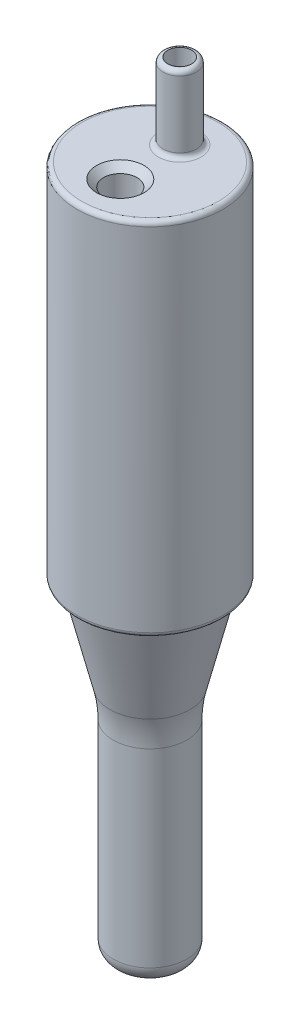
ISO-10303-21;
HEADER;
FILE_DESCRIPTION(('STEP AP214'),'2;1');
FILE_NAME('part.step','',(''),(''),'','','');
FILE_SCHEMA(('AUTOMOTIVE_DESIGN { 1 0 10303 214 1 1 1 1 }'));
ENDSEC;
DATA;
#1=APPLICATION_CONTEXT('core data for automotive mechanical design processes');
#2=APPLICATION_PROTOCOL_DEFINITION('international standard','automotive_design',2000,#1);
#3=PRODUCT_CONTEXT('',#1,'mechanical');
#4=PRODUCT('Part','Part','',(#3));
#5=PRODUCT_RELATED_PRODUCT_CATEGORY('part','',(#4));
#6=PRODUCT_DEFINITION_FORMATION('','',#4);
#7=PRODUCT_DEFINITION_CONTEXT('part definition',#1,'design');
#8=PRODUCT_DEFINITION('design','',#6,#7);
#9=PRODUCT_DEFINITION_SHAPE('','',#8);
#10=(LENGTH_UNIT() NAMED_UNIT(*) SI_UNIT(.MILLI.,.METRE.));
#11=(NAMED_UNIT(*) PLANE_ANGLE_UNIT() SI_UNIT($,.RADIAN.));
#12=(NAMED_UNIT(*) SI_UNIT($,.STERADIAN.) SOLID_ANGLE_UNIT());
#13=UNCERTAINTY_MEASURE_WITH_UNIT(LENGTH_MEASURE(1.E-05),#10,'distance_accuracy_value','');
#14=(GEOMETRIC_REPRESENTATION_CONTEXT(3) GLOBAL_UNCERTAINTY_ASSIGNED_CONTEXT((#13)) GLOBAL_UNIT_ASSIGNED_CONTEXT((#10,
#11,#12)) REPRESENTATION_CONTEXT('',''));
#15=CARTESIAN_POINT('',(0.,0.,0.));
#16=DIRECTION('',(0.,0.,1.));
#17=DIRECTION('',(1.,0.,0.));
#18=AXIS2_PLACEMENT_3D('',#15,#16,#17);
#19=CARTESIAN_POINT('',(0.,0.,-7.81));
#20=DIRECTION('',(0.,-1.,0.));
#21=DIRECTION('',(0.,0.,-1.));
#22=AXIS2_PLACEMENT_3D('',#19,#20,#21);
#23=PLANE('',#22);
#24=CARTESIAN_POINT('',(0.,0.,0.));
#25=DIRECTION('',(0.,-1.,0.));
#26=DIRECTION('',(0.,0.,-1.));
#27=AXIS2_PLACEMENT_3D('',#24,#25,#26);
#28=CIRCLE('',#27,7.31);
#29=CARTESIAN_POINT('',(0.,0.,-7.31));
#30=VERTEX_POINT('',#29);
#31=EDGE_CURVE('E60',#30,#30,#28,.T.);
#32=ORIENTED_EDGE('',*,*,#31,.T.);
#33=EDGE_LOOP('',(#32));
#34=FACE_BOUND('',#33,.T.);
#35=CARTESIAN_POINT('',(0.,0.,0.));
#36=DIRECTION('',(0.,-1.,0.));
#37=DIRECTION('',(0.,0.,-1.));
#38=AXIS2_PLACEMENT_3D('',#35,#36,#37);
#39=CIRCLE('',#38,6.73);
#40=CARTESIAN_POINT('',(0.,0.,-6.73));
#41=VERTEX_POINT('',#40);
#42=EDGE_CURVE('E90',#41,#41,#39,.T.);
#43=ORIENTED_EDGE('',*,*,#42,.F.);
#44=EDGE_LOOP('',(#43));
#45=FACE_BOUND('',#44,.T.);
#46=ADVANCED_FACE('F37',(#34,#45),#23,.T.);
#47=CARTESIAN_POINT('',(0.,-34.9196671252025,0.));
#48=DIRECTION('',(0.,-1.,0.));
#49=DIRECTION('',(0.,0.,-1.));
#50=AXIS2_PLACEMENT_3D('',#47,#48,#49);
#51=CYLINDRICAL_SURFACE('',#50,7.81);
#52=CARTESIAN_POINT('',(0.,0.5,0.));
#53=DIRECTION('',(0.,-1.,0.));
#54=DIRECTION('',(0.,0.,-1.));
#55=AXIS2_PLACEMENT_3D('',#52,#53,#54);
#56=CIRCLE('',#55,7.81);
#57=CARTESIAN_POINT('',(0.,0.5,-7.81));
#58=VERTEX_POINT('',#57);
#59=EDGE_CURVE('E52',#58,#58,#56,.F.);
#60=ORIENTED_EDGE('',*,*,#59,.T.);
#61=EDGE_LOOP('',(#60));
#62=FACE_BOUND('',#61,.T.);
#63=CARTESIAN_POINT('',(0.,38.11,0.));
#64=DIRECTION('',(0.,1.,0.));
#65=DIRECTION('',(0.,0.,1.));
#66=AXIS2_PLACEMENT_3D('',#63,#64,#65);
#67=CIRCLE('',#66,7.81);
#68=CARTESIAN_POINT('',(0.,38.11,7.81));
#69=VERTEX_POINT('',#68);
#70=EDGE_CURVE('E57',#69,#69,#67,.F.);
#71=ORIENTED_EDGE('',*,*,#70,.T.);
#72=EDGE_LOOP('',(#71));
#73=FACE_BOUND('',#72,.T.);
#74=ADVANCED_FACE('F115',(#62,#73),#51,.T.);
#75=CARTESIAN_POINT('',(0.,38.61,-7.81));
#76=DIRECTION('',(0.,1.,0.));
#77=DIRECTION('',(0.,0.,1.));
#78=AXIS2_PLACEMENT_3D('',#75,#76,#77);
#79=PLANE('',#78);
#80=CARTESIAN_POINT('',(0.,38.61,3.18));
#81=DIRECTION('',(0.,1.,0.));
#82=DIRECTION('',(0.,0.,1.));
#83=AXIS2_PLACEMENT_3D('',#80,#81,#82);
#84=CIRCLE('',#83,2.53500000000002);
#85=CARTESIAN_POINT('',(0.,38.61,5.71500000000002));
#86=VERTEX_POINT('',#85);
#87=EDGE_CURVE('E10',#86,#86,#84,.F.);
#88=ORIENTED_EDGE('',*,*,#87,.T.);
#89=EDGE_LOOP('',(#88));
#90=FACE_BOUND('',#89,.T.);
#91=CARTESIAN_POINT('',(0.,38.61,0.));
#92=DIRECTION('',(0.,1.,0.));
#93=DIRECTION('',(0.,0.,1.));
#94=AXIS2_PLACEMENT_3D('',#91,#92,#93);
#95=CIRCLE('',#94,7.31);
#96=CARTESIAN_POINT('',(0.,38.61,7.31));
#97=VERTEX_POINT('',#96);
#98=EDGE_CURVE('E48',#97,#97,#95,.T.);
#99=ORIENTED_EDGE('',*,*,#98,.T.);
#100=EDGE_LOOP('',(#99));
#101=FACE_BOUND('',#100,.T.);
#102=CARTESIAN_POINT('',(0.,38.61,-3.18));
#103=DIRECTION('',(0.,1.,0.));
#104=DIRECTION('',(0.,0.,1.));
#105=AXIS2_PLACEMENT_3D('',#102,#103,#104);
#106=CIRCLE('',#105,2.285);
#107=CARTESIAN_POINT('',(0.,38.61,-0.895000000000001));
#108=VERTEX_POINT('',#107);
#109=EDGE_CURVE('E63',#108,#108,#106,.F.);
#110=ORIENTED_EDGE('',*,*,#109,.T.);
#111=EDGE_LOOP('',(#110));
#112=FACE_BOUND('',#111,.T.);
#113=ADVANCED_FACE('F121',(#90,#101,#112),#79,.T.);
#114=CARTESIAN_POINT('',(0.,-34.9196671252025,-2.91350987215696));
#115=DIRECTION('',(0.,-1.,0.));
#116=DIRECTION('',(0.,0.,-1.));
#117=AXIS2_PLACEMENT_3D('',#114,#115,#116);
#118=PLANE('',#117);
#119=CARTESIAN_POINT('',(0.,-34.9196671252025,0.));
#120=DIRECTION('',(0.,-1.,0.));
#121=DIRECTION('',(0.,0.,-1.));
#122=AXIS2_PLACEMENT_3D('',#119,#120,#121);
#123=CIRCLE('',#122,2.91350987215696);
#124=CARTESIAN_POINT('',(0.,-34.9196671252025,-2.91350987215696));
#125=VERTEX_POINT('',#124);
#126=EDGE_CURVE('E78',#125,#125,#123,.T.);
#127=ORIENTED_EDGE('',*,*,#126,.T.);
#128=EDGE_LOOP('',(#127));
#129=FACE_BOUND('',#128,.T.);
#130=ADVANCED_FACE('F171',(#129),#118,.T.);
#131=CARTESIAN_POINT('',(0.,-33.296671252025,0.));
#132=DIRECTION('',(0.,-1.,0.));
#133=DIRECTION('',(0.,0.,-1.));
#134=AXIS2_PLACEMENT_3D('',#131,#132,#133);
#135=TOROIDAL_SURFACE('',#134,2.13512410940905,1.8);
#136=CARTESIAN_POINT('',(0.,-33.296671252025,0.));
#137=DIRECTION('',(0.,-1.,0.));
#138=DIRECTION('',(0.,0.,-1.));
#139=AXIS2_PLACEMENT_3D('',#136,#137,#138);
#140=CIRCLE('',#139,3.93512410940904);
#141=CARTESIAN_POINT('',(0.,-33.296671252025,-3.93512410940904));
#142=VERTEX_POINT('',#141);
#143=EDGE_CURVE('E81',#142,#142,#140,.T.);
#144=ORIENTED_EDGE('',*,*,#143,.T.);
#145=EDGE_LOOP('',(#144));
#146=FACE_BOUND('',#145,.T.);
#147=ORIENTED_EDGE('',*,*,#126,.F.);
#148=EDGE_LOOP('',(#147));
#149=FACE_BOUND('',#148,.T.);
#150=ADVANCED_FACE('F197',(#146,#149),#135,.T.);
#151=CARTESIAN_POINT('',(0.,-34.9196671252025,0.));
#152=DIRECTION('',(0.,-1.,0.));
#153=DIRECTION('',(0.,0.,-1.));
#154=AXIS2_PLACEMENT_3D('',#151,#152,#153);
#155=CYLINDRICAL_SURFACE('',#154,3.93512410940904);
#156=CARTESIAN_POINT('',(0.,-13.0000303406302,0.));
#157=DIRECTION('',(0.,-1.,0.));
#158=DIRECTION('',(0.,0.,-1.));
#159=AXIS2_PLACEMENT_3D('',#156,#157,#158);
#160=CIRCLE('',#159,3.93512410940904);
#161=CARTESIAN_POINT('',(0.,-13.0000303406302,-3.93512410940904));
#162=VERTEX_POINT('',#161);
#163=EDGE_CURVE('E84',#162,#162,#160,.T.);
#164=ORIENTED_EDGE('',*,*,#163,.T.);
#165=EDGE_LOOP('',(#164));
#166=FACE_BOUND('',#165,.T.);
#167=ORIENTED_EDGE('',*,*,#143,.F.);
#168=EDGE_LOOP('',(#167));
#169=FACE_BOUND('',#168,.T.);
#170=ADVANCED_FACE('F205',(#166,#169),#155,.T.);
#171=CARTESIAN_POINT('',(0.,-12.9153836700121,0.));
#172=DIRECTION('',(0.,-1.,0.));
#173=DIRECTION('',(0.,0.,-1.));
#174=AXIS2_PLACEMENT_3D('',#171,#172,#173);
#175=TOROIDAL_SURFACE('',#174,16.2348328434057,12.3);
#176=CARTESIAN_POINT('',(0.,-9.99445860185392,0.));
#177=DIRECTION('',(0.,-1.,0.));
#178=DIRECTION('',(0.,0.,-1.));
#179=AXIS2_PLACEMENT_3D('',#176,#177,#178);
#180=CIRCLE('',#179,4.28668667982847);
#181=CARTESIAN_POINT('',(0.,-9.99445860185392,-4.28668667982847));
#182=VERTEX_POINT('',#181);
#183=EDGE_CURVE('E87',#182,#182,#180,.T.);
#184=ORIENTED_EDGE('',*,*,#183,.T.);
#185=EDGE_LOOP('',(#184));
#186=FACE_BOUND('',#185,.T.);
#187=ORIENTED_EDGE('',*,*,#163,.F.);
#188=EDGE_LOOP('',(#187));
#189=FACE_BOUND('',#188,.T.);
#190=ADVANCED_FACE('F213',(#186,#189),#175,.F.);
#191=CARTESIAN_POINT('',(0.,-9.99445860185392,0.));
#192=DIRECTION('',(0.,1.,0.));
#193=DIRECTION('',(0.,0.,1.));
#194=AXIS2_PLACEMENT_3D('',#191,#192,#193);
#195=CONICAL_SURFACE('',#194,4.28668667982847,0.239764204581695);
#196=ORIENTED_EDGE('',*,*,#42,.T.);
#197=EDGE_LOOP('',(#196));
#198=FACE_BOUND('',#197,.T.);
#199=ORIENTED_EDGE('',*,*,#183,.F.);
#200=EDGE_LOOP('',(#199));
#201=FACE_BOUND('',#200,.T.);
#202=ADVANCED_FACE('F221',(#198,#201),#195,.T.);
#203=CARTESIAN_POINT('',(0.,46.74,-3.18));
#204=DIRECTION('',(0.,-1.,0.));
#205=DIRECTION('',(0.,0.,-1.));
#206=AXIS2_PLACEMENT_3D('',#203,#204,#205);
#207=CYLINDRICAL_SURFACE('',#206,1.785);
#208=CARTESIAN_POINT('',(0.,39.11,-3.18));
#209=DIRECTION('',(0.,1.,0.));
#210=DIRECTION('',(0.,0.,1.));
#211=AXIS2_PLACEMENT_3D('',#208,#209,#210);
#212=CIRCLE('',#211,1.785);
#213=CARTESIAN_POINT('',(0.,39.11,-1.395));
#214=VERTEX_POINT('',#213);
#215=EDGE_CURVE('E66',#214,#214,#212,.T.);
#216=ORIENTED_EDGE('',*,*,#215,.T.);
#217=EDGE_LOOP('',(#216));
#218=FACE_BOUND('',#217,.T.);
#219=CARTESIAN_POINT('',(0.,46.24,-3.18));
#220=DIRECTION('',(0.,1.,0.));
#221=DIRECTION('',(0.,0.,1.));
#222=AXIS2_PLACEMENT_3D('',#219,#220,#221);
#223=CIRCLE('',#222,1.785);
#224=CARTESIAN_POINT('',(0.,46.24,-1.395));
#225=VERTEX_POINT('',#224);
#226=EDGE_CURVE('E69',#225,#225,#223,.F.);
#227=ORIENTED_EDGE('',*,*,#226,.T.);
#228=EDGE_LOOP('',(#227));
#229=FACE_BOUND('',#228,.T.);
#230=ADVANCED_FACE('F229',(#218,#229),#207,.T.);
#231=CARTESIAN_POINT('',(0.,46.74,-3.18));
#232=DIRECTION('',(0.,-1.,0.));
#233=DIRECTION('',(0.,0.,-1.));
#234=AXIS2_PLACEMENT_3D('',#231,#232,#233);
#235=CYLINDRICAL_SURFACE('',#234,1.27);
#236=CARTESIAN_POINT('',(0.,46.74,-3.18));
#237=DIRECTION('',(0.,1.,0.));
#238=DIRECTION('',(0.,0.,1.));
#239=AXIS2_PLACEMENT_3D('',#236,#237,#238);
#240=CIRCLE('',#239,1.27);
#241=CARTESIAN_POINT('',(0.,46.74,-1.91));
#242=VERTEX_POINT('',#241);
#243=EDGE_CURVE('E93',#242,#242,#240,.T.);
#244=ORIENTED_EDGE('',*,*,#243,.T.);
#245=EDGE_LOOP('',(#244));
#246=FACE_BOUND('',#245,.T.);
#247=CARTESIAN_POINT('',(0.,38.61,-3.18));
#248=DIRECTION('',(0.,1.,0.));
#249=DIRECTION('',(0.,0.,1.));
#250=AXIS2_PLACEMENT_3D('',#247,#248,#249);
#251=CIRCLE('',#250,1.27);
#252=CARTESIAN_POINT('',(0.,38.61,-1.91));
#253=VERTEX_POINT('',#252);
#254=EDGE_CURVE('E75',#253,#253,#251,.F.);
#255=ORIENTED_EDGE('',*,*,#254,.T.);
#256=EDGE_LOOP('',(#255));
#257=FACE_BOUND('',#256,.T.);
#258=ADVANCED_FACE('F238',(#246,#257),#235,.F.);
#259=CARTESIAN_POINT('',(0.,46.74,0.));
#260=DIRECTION('',(0.,1.,0.));
#261=DIRECTION('',(0.,0.,1.));
#262=AXIS2_PLACEMENT_3D('',#259,#260,#261);
#263=PLANE('',#262);
#264=CARTESIAN_POINT('',(0.,46.74,-3.18));
#265=DIRECTION('',(0.,1.,0.));
#266=DIRECTION('',(0.,0.,1.));
#267=AXIS2_PLACEMENT_3D('',#264,#265,#266);
#268=CIRCLE('',#267,1.285);
#269=CARTESIAN_POINT('',(0.,46.74,-1.895));
#270=VERTEX_POINT('',#269);
#271=EDGE_CURVE('E72',#270,#270,#268,.T.);
#272=ORIENTED_EDGE('',*,*,#271,.T.);
#273=EDGE_LOOP('',(#272));
#274=FACE_BOUND('',#273,.T.);
#275=ORIENTED_EDGE('',*,*,#243,.F.);
#276=EDGE_LOOP('',(#275));
#277=FACE_BOUND('',#276,.T.);
#278=ADVANCED_FACE('F246',(#274,#277),#263,.T.);
#279=ORIENTED_EDGE('',*,*,#254,.F.);
#280=EDGE_LOOP('',(#279));
#281=FACE_BOUND('',#280,.T.);
#282=ADVANCED_FACE('F131',(#281),#79,.T.);
#283=CARTESIAN_POINT('',(0.,46.24,-3.18));
#284=DIRECTION('',(0.,1.,0.));
#285=DIRECTION('',(0.,0.,1.));
#286=AXIS2_PLACEMENT_3D('',#283,#284,#285);
#287=TOROIDAL_SURFACE('',#286,1.285,0.5);
#288=ORIENTED_EDGE('',*,*,#226,.F.);
#289=EDGE_LOOP('',(#288));
#290=FACE_BOUND('',#289,.T.);
#291=ORIENTED_EDGE('',*,*,#271,.F.);
#292=EDGE_LOOP('',(#291));
#293=FACE_BOUND('',#292,.T.);
#294=ADVANCED_FACE('F127',(#290,#293),#287,.T.);
#295=CARTESIAN_POINT('',(0.,39.11,-3.18));
#296=DIRECTION('',(0.,1.,0.));
#297=DIRECTION('',(0.,0.,1.));
#298=AXIS2_PLACEMENT_3D('',#295,#296,#297);
#299=TOROIDAL_SURFACE('',#298,2.285,0.5);
#300=ORIENTED_EDGE('',*,*,#109,.F.);
#301=EDGE_LOOP('',(#300));
#302=FACE_BOUND('',#301,.T.);
#303=ORIENTED_EDGE('',*,*,#215,.F.);
#304=EDGE_LOOP('',(#303));
#305=FACE_BOUND('',#304,.T.);
#306=ADVANCED_FACE('F130',(#302,#305),#299,.F.);
#307=CARTESIAN_POINT('',(0.,0.5,0.));
#308=DIRECTION('',(0.,-1.,0.));
#309=DIRECTION('',(0.,0.,-1.));
#310=AXIS2_PLACEMENT_3D('',#307,#308,#309);
#311=TOROIDAL_SURFACE('',#310,7.31,0.5);
#312=ORIENTED_EDGE('',*,*,#59,.F.);
#313=EDGE_LOOP('',(#312));
#314=FACE_BOUND('',#313,.T.);
#315=ORIENTED_EDGE('',*,*,#31,.F.);
#316=EDGE_LOOP('',(#315));
#317=FACE_BOUND('',#316,.T.);
#318=ADVANCED_FACE('F111',(#314,#317),#311,.T.);
#319=CARTESIAN_POINT('',(0.,38.11,0.));
#320=DIRECTION('',(0.,1.,0.));
#321=DIRECTION('',(0.,0.,1.));
#322=AXIS2_PLACEMENT_3D('',#319,#320,#321);
#323=TOROIDAL_SURFACE('',#322,7.31,0.5);
#324=ORIENTED_EDGE('',*,*,#98,.F.);
#325=EDGE_LOOP('',(#324));
#326=FACE_BOUND('',#325,.T.);
#327=ORIENTED_EDGE('',*,*,#70,.F.);
#328=EDGE_LOOP('',(#327));
#329=FACE_BOUND('',#328,.T.);
#330=ADVANCED_FACE('F104',(#326,#329),#323,.T.);
#331=CARTESIAN_POINT('',(0.,21.61,3.18));
#332=DIRECTION('',(0.,1.,0.));
#333=DIRECTION('',(0.,0.,1.));
#334=AXIS2_PLACEMENT_3D('',#331,#332,#333);
#335=CYLINDRICAL_SURFACE('',#334,1.785);
#336=CARTESIAN_POINT('',(0.,37.86,3.18));
#337=DIRECTION('',(0.,1.,0.));
#338=DIRECTION('',(0.,0.,1.));
#339=AXIS2_PLACEMENT_3D('',#336,#337,#338);
#340=CIRCLE('',#339,1.785);
#341=CARTESIAN_POINT('',(0.,37.86,4.965));
#342=VERTEX_POINT('',#341);
#343=EDGE_CURVE('E44',#342,#342,#340,.T.);
#344=ORIENTED_EDGE('',*,*,#343,.T.);
#345=EDGE_LOOP('',(#344));
#346=FACE_BOUND('',#345,.T.);
#347=CARTESIAN_POINT('',(0.,21.61,3.18));
#348=DIRECTION('',(0.,1.,0.));
#349=DIRECTION('',(0.,0.,1.));
#350=AXIS2_PLACEMENT_3D('',#347,#348,#349);
#351=CIRCLE('',#350,1.785);
#352=CARTESIAN_POINT('',(0.,21.61,4.965));
#353=VERTEX_POINT('',#352);
#354=EDGE_CURVE('E96',#353,#353,#351,.T.);
#355=ORIENTED_EDGE('',*,*,#354,.F.);
#356=EDGE_LOOP('',(#355));
#357=FACE_BOUND('',#356,.T.);
#358=ADVANCED_FACE('F102',(#346,#357),#335,.F.);
#359=CARTESIAN_POINT('',(0.,21.61,0.));
#360=DIRECTION('',(0.,1.,0.));
#361=DIRECTION('',(0.,0.,1.));
#362=AXIS2_PLACEMENT_3D('',#359,#360,#361);
#363=PLANE('',#362);
#364=ORIENTED_EDGE('',*,*,#354,.T.);
#365=EDGE_LOOP('',(#364));
#366=FACE_BOUND('',#365,.T.);
#367=ADVANCED_FACE('F100',(#366),#363,.T.);
#368=CARTESIAN_POINT('',(0.,37.86,3.18));
#369=DIRECTION('',(0.,1.,0.));
#370=DIRECTION('',(0.,0.,1.));
#371=AXIS2_PLACEMENT_3D('',#368,#369,#370);
#372=CONICAL_SURFACE('',#371,1.785,0.78539816339745);
#373=ORIENTED_EDGE('',*,*,#87,.F.);
#374=EDGE_LOOP('',(#373));
#375=FACE_BOUND('',#374,.T.);
#376=ORIENTED_EDGE('',*,*,#343,.F.);
#377=EDGE_LOOP('',(#376));
#378=FACE_BOUND('',#377,.T.);
#379=ADVANCED_FACE('F39',(#375,#378),#372,.F.);
#380=CLOSED_SHELL('',(#46,#74,#113,#130,#150,#170,#190,#202,#230,#258,#278,#282,#294,#306,#318,
#330,#358,#367,#379));
#381=MANIFOLD_SOLID_BREP('B2',#380);
#382=ADVANCED_BREP_SHAPE_REPRESENTATION('',(#18,#381),#14);
#383=SHAPE_DEFINITION_REPRESENTATION(#9,#382);
ENDSEC;
END-ISO-10303-21;
